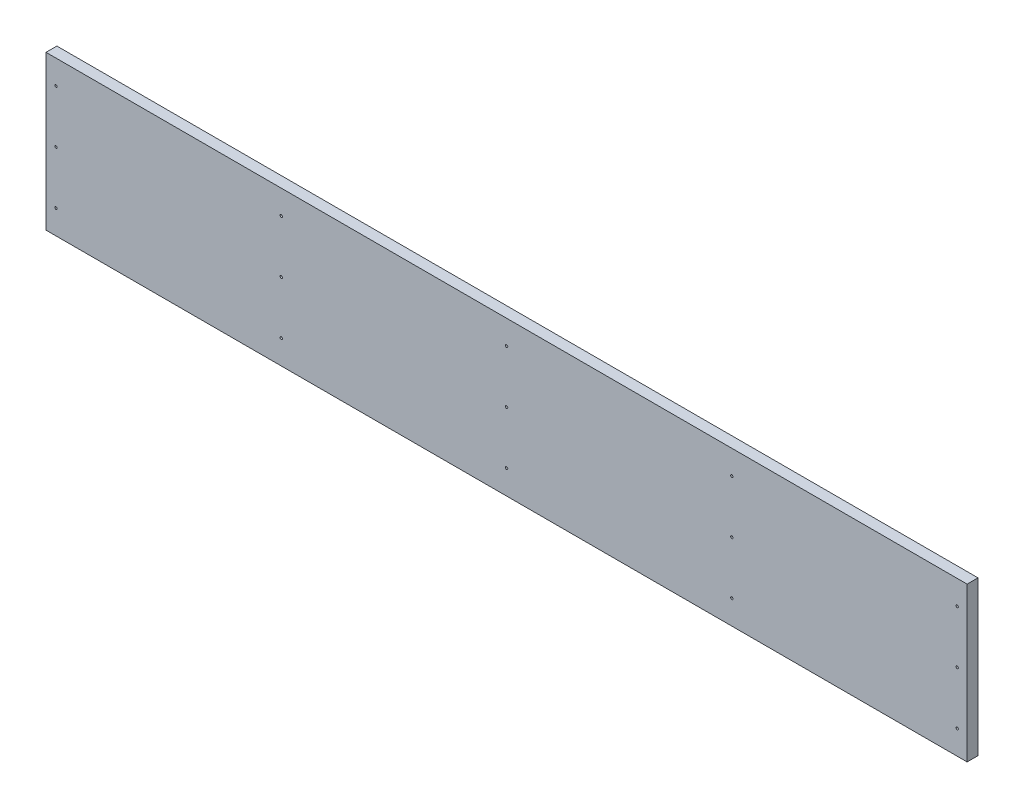
ISO-10303-21;
HEADER;
FILE_DESCRIPTION(('STEP AP214'),'2;1');
FILE_NAME('part.step','',(''),(''),'','','');
FILE_SCHEMA(('AUTOMOTIVE_DESIGN { 1 0 10303 214 1 1 1 1 }'));
ENDSEC;
DATA;
#1=APPLICATION_CONTEXT('core data for automotive mechanical design processes');
#2=APPLICATION_PROTOCOL_DEFINITION('international standard','automotive_design',2000,#1);
#3=PRODUCT_CONTEXT('',#1,'mechanical');
#4=PRODUCT('Part','Part','',(#3));
#5=PRODUCT_RELATED_PRODUCT_CATEGORY('part','',(#4));
#6=PRODUCT_DEFINITION_FORMATION('','',#4);
#7=PRODUCT_DEFINITION_CONTEXT('part definition',#1,'design');
#8=PRODUCT_DEFINITION('design','',#6,#7);
#9=PRODUCT_DEFINITION_SHAPE('','',#8);
#10=(LENGTH_UNIT() NAMED_UNIT(*) SI_UNIT(.MILLI.,.METRE.));
#11=(NAMED_UNIT(*) PLANE_ANGLE_UNIT() SI_UNIT($,.RADIAN.));
#12=(NAMED_UNIT(*) SI_UNIT($,.STERADIAN.) SOLID_ANGLE_UNIT());
#13=UNCERTAINTY_MEASURE_WITH_UNIT(LENGTH_MEASURE(1.E-05),#10,'distance_accuracy_value','');
#14=(GEOMETRIC_REPRESENTATION_CONTEXT(3) GLOBAL_UNCERTAINTY_ASSIGNED_CONTEXT((#13)) GLOBAL_UNIT_ASSIGNED_CONTEXT((#10,
#11,#12)) REPRESENTATION_CONTEXT('',''));
#15=CARTESIAN_POINT('',(0.,0.,0.));
#16=DIRECTION('',(0.,0.,1.));
#17=DIRECTION('',(1.,0.,0.));
#18=AXIS2_PLACEMENT_3D('',#15,#16,#17);
#19=CARTESIAN_POINT('',(762.499999999999,127.5,18.));
#20=DIRECTION('',(-1.,0.,0.));
#21=DIRECTION('',(0.,-1.,0.));
#22=AXIS2_PLACEMENT_3D('',#19,#20,#21);
#23=PLANE('',#22);
#24=DIRECTION('',(0.,1.,0.));
#25=VECTOR('',#24,1.);
#26=CARTESIAN_POINT('',(762.499999999999,127.5,0.));
#27=LINE('',#26,#25);
#28=CARTESIAN_POINT('',(762.499999999999,-127.5,0.));
#29=VERTEX_POINT('',#28);
#30=CARTESIAN_POINT('',(762.499999999999,127.5,0.));
#31=VERTEX_POINT('',#30);
#32=EDGE_CURVE('E107',#29,#31,#27,.T.);
#33=ORIENTED_EDGE('',*,*,#32,.T.);
#34=DIRECTION('',(0.,0.,-1.));
#35=VECTOR('',#34,1.);
#36=CARTESIAN_POINT('',(762.499999999999,127.5,18.));
#37=LINE('',#36,#35);
#38=CARTESIAN_POINT('',(762.499999999999,127.5,18.));
#39=VERTEX_POINT('',#38);
#40=EDGE_CURVE('E13',#39,#31,#37,.T.);
#41=ORIENTED_EDGE('',*,*,#40,.F.);
#42=DIRECTION('',(0.,1.,0.));
#43=VECTOR('',#42,1.);
#44=CARTESIAN_POINT('',(762.499999999999,127.5,18.));
#45=LINE('',#44,#43);
#46=CARTESIAN_POINT('',(762.499999999999,-127.5,18.));
#47=VERTEX_POINT('',#46);
#48=EDGE_CURVE('E95',#47,#39,#45,.T.);
#49=ORIENTED_EDGE('',*,*,#48,.F.);
#50=DIRECTION('',(0.,0.,-1.));
#51=VECTOR('',#50,1.);
#52=CARTESIAN_POINT('',(762.499999999999,-127.5,18.));
#53=LINE('',#52,#51);
#54=EDGE_CURVE('E103',#47,#29,#53,.T.);
#55=ORIENTED_EDGE('',*,*,#54,.T.);
#56=EDGE_LOOP('',(#33,#41,#49,#55));
#57=FACE_BOUND('',#56,.T.);
#58=ADVANCED_FACE('F44',(#57),#23,.F.);
#59=CARTESIAN_POINT('',(-762.500000000001,127.5,18.));
#60=DIRECTION('',(0.,-1.,0.));
#61=DIRECTION('',(0.,0.,-1.));
#62=AXIS2_PLACEMENT_3D('',#59,#60,#61);
#63=PLANE('',#62);
#64=DIRECTION('',(-1.,0.,0.));
#65=VECTOR('',#64,1.);
#66=CARTESIAN_POINT('',(-762.500000000001,127.5,0.));
#67=LINE('',#66,#65);
#68=CARTESIAN_POINT('',(-762.500000000001,127.5,0.));
#69=VERTEX_POINT('',#68);
#70=EDGE_CURVE('E99',#31,#69,#67,.T.);
#71=ORIENTED_EDGE('',*,*,#70,.T.);
#72=DIRECTION('',(0.,0.,-1.));
#73=VECTOR('',#72,1.);
#74=CARTESIAN_POINT('',(-762.500000000001,127.5,18.));
#75=LINE('',#74,#73);
#76=CARTESIAN_POINT('',(-762.500000000001,127.5,18.));
#77=VERTEX_POINT('',#76);
#78=EDGE_CURVE('E52',#77,#69,#75,.T.);
#79=ORIENTED_EDGE('',*,*,#78,.F.);
#80=DIRECTION('',(-1.,0.,0.));
#81=VECTOR('',#80,1.);
#82=CARTESIAN_POINT('',(-762.500000000001,127.5,18.));
#83=LINE('',#82,#81);
#84=EDGE_CURVE('E90',#39,#77,#83,.T.);
#85=ORIENTED_EDGE('',*,*,#84,.F.);
#86=ORIENTED_EDGE('',*,*,#40,.T.);
#87=EDGE_LOOP('',(#71,#79,#85,#86));
#88=FACE_BOUND('',#87,.T.);
#89=ADVANCED_FACE('F98',(#88),#63,.F.);
#90=CARTESIAN_POINT('',(-762.500000000001,127.5,18.));
#91=DIRECTION('',(1.,0.,0.));
#92=DIRECTION('',(0.,0.,-1.));
#93=AXIS2_PLACEMENT_3D('',#90,#91,#92);
#94=PLANE('',#93);
#95=DIRECTION('',(0.,-1.,0.));
#96=VECTOR('',#95,1.);
#97=CARTESIAN_POINT('',(-762.500000000001,127.5,0.));
#98=LINE('',#97,#96);
#99=CARTESIAN_POINT('',(-762.500000000001,-127.5,0.));
#100=VERTEX_POINT('',#99);
#101=EDGE_CURVE('E77',#69,#100,#98,.T.);
#102=ORIENTED_EDGE('',*,*,#101,.T.);
#103=DIRECTION('',(0.,0.,-1.));
#104=VECTOR('',#103,1.);
#105=CARTESIAN_POINT('',(-762.500000000001,-127.5,18.));
#106=LINE('',#105,#104);
#107=CARTESIAN_POINT('',(-762.500000000001,-127.5,18.));
#108=VERTEX_POINT('',#107);
#109=EDGE_CURVE('E100',#108,#100,#106,.T.);
#110=ORIENTED_EDGE('',*,*,#109,.F.);
#111=DIRECTION('',(0.,-1.,0.));
#112=VECTOR('',#111,1.);
#113=CARTESIAN_POINT('',(-762.500000000001,127.5,18.));
#114=LINE('',#113,#112);
#115=EDGE_CURVE('E93',#77,#108,#114,.T.);
#116=ORIENTED_EDGE('',*,*,#115,.F.);
#117=ORIENTED_EDGE('',*,*,#78,.T.);
#118=EDGE_LOOP('',(#102,#110,#116,#117));
#119=FACE_BOUND('',#118,.T.);
#120=ADVANCED_FACE('F101',(#119),#94,.F.);
#121=CARTESIAN_POINT('',(-762.500000000001,-127.5,18.));
#122=DIRECTION('',(0.,1.,0.));
#123=DIRECTION('',(0.,0.,1.));
#124=AXIS2_PLACEMENT_3D('',#121,#122,#123);
#125=PLANE('',#124);
#126=DIRECTION('',(1.,0.,0.));
#127=VECTOR('',#126,1.);
#128=CARTESIAN_POINT('',(-762.500000000001,-127.5,0.));
#129=LINE('',#128,#127);
#130=EDGE_CURVE('E83',#100,#29,#129,.T.);
#131=ORIENTED_EDGE('',*,*,#130,.T.);
#132=ORIENTED_EDGE('',*,*,#54,.F.);
#133=DIRECTION('',(1.,0.,0.));
#134=VECTOR('',#133,1.);
#135=CARTESIAN_POINT('',(-762.500000000001,-127.5,18.));
#136=LINE('',#135,#134);
#137=EDGE_CURVE('E60',#108,#47,#136,.T.);
#138=ORIENTED_EDGE('',*,*,#137,.F.);
#139=ORIENTED_EDGE('',*,*,#109,.T.);
#140=EDGE_LOOP('',(#131,#132,#138,#139));
#141=FACE_BOUND('',#140,.T.);
#142=ADVANCED_FACE('F115',(#141),#125,.F.);
#143=CARTESIAN_POINT('',(0.,0.,18.));
#144=DIRECTION('',(0.,0.,1.));
#145=DIRECTION('',(1.,0.,0.));
#146=AXIS2_PLACEMENT_3D('',#143,#144,#145);
#147=PLANE('',#146);
#148=CARTESIAN_POINT('',(-6.66133814775094E-13,-87.5,18.));
#149=DIRECTION('',(0.,0.,1.));
#150=DIRECTION('',(1.,0.,0.));
#151=AXIS2_PLACEMENT_3D('',#148,#149,#150);
#152=CIRCLE('',#151,2.);
#153=CARTESIAN_POINT('',(1.99999999999933,-87.5,18.));
#154=VERTEX_POINT('',#153);
#155=EDGE_CURVE('E180',#154,#154,#152,.T.);
#156=ORIENTED_EDGE('',*,*,#155,.F.);
#157=EDGE_LOOP('',(#156));
#158=FACE_BOUND('',#157,.T.);
#159=CARTESIAN_POINT('',(372.999999999999,87.4999999999999,18.));
#160=DIRECTION('',(0.,0.,1.));
#161=DIRECTION('',(1.,0.,0.));
#162=AXIS2_PLACEMENT_3D('',#159,#160,#161);
#163=CIRCLE('',#162,2.);
#164=CARTESIAN_POINT('',(374.999999999999,87.4999999999999,18.));
#165=VERTEX_POINT('',#164);
#166=EDGE_CURVE('E172',#165,#165,#163,.T.);
#167=ORIENTED_EDGE('',*,*,#166,.F.);
#168=EDGE_LOOP('',(#167));
#169=FACE_BOUND('',#168,.T.);
#170=CARTESIAN_POINT('',(372.999999999999,0.,18.));
#171=DIRECTION('',(0.,0.,1.));
#172=DIRECTION('',(1.,0.,0.));
#173=AXIS2_PLACEMENT_3D('',#170,#171,#172);
#174=CIRCLE('',#173,2.);
#175=CARTESIAN_POINT('',(374.999999999999,0.,18.));
#176=VERTEX_POINT('',#175);
#177=EDGE_CURVE('E173',#176,#176,#174,.T.);
#178=ORIENTED_EDGE('',*,*,#177,.F.);
#179=EDGE_LOOP('',(#178));
#180=FACE_BOUND('',#179,.T.);
#181=CARTESIAN_POINT('',(745.999999999999,-87.5,18.));
#182=DIRECTION('',(0.,0.,1.));
#183=DIRECTION('',(1.,0.,0.));
#184=AXIS2_PLACEMENT_3D('',#181,#182,#183);
#185=CIRCLE('',#184,2.);
#186=CARTESIAN_POINT('',(747.999999999999,-87.5,18.));
#187=VERTEX_POINT('',#186);
#188=EDGE_CURVE('E203',#187,#187,#185,.T.);
#189=ORIENTED_EDGE('',*,*,#188,.F.);
#190=EDGE_LOOP('',(#189));
#191=FACE_BOUND('',#190,.T.);
#192=CARTESIAN_POINT('',(745.999999999999,0.,18.));
#193=DIRECTION('',(0.,0.,1.));
#194=DIRECTION('',(1.,0.,0.));
#195=AXIS2_PLACEMENT_3D('',#192,#193,#194);
#196=CIRCLE('',#195,2.);
#197=CARTESIAN_POINT('',(747.999999999999,0.,18.));
#198=VERTEX_POINT('',#197);
#199=EDGE_CURVE('E202',#198,#198,#196,.T.);
#200=ORIENTED_EDGE('',*,*,#199,.F.);
#201=EDGE_LOOP('',(#200));
#202=FACE_BOUND('',#201,.T.);
#203=CARTESIAN_POINT('',(745.999999999999,87.4999999999999,18.));
#204=DIRECTION('',(0.,0.,1.));
#205=DIRECTION('',(1.,0.,0.));
#206=AXIS2_PLACEMENT_3D('',#203,#204,#205);
#207=CIRCLE('',#206,2.);
#208=CARTESIAN_POINT('',(747.999999999999,87.4999999999999,18.));
#209=VERTEX_POINT('',#208);
#210=EDGE_CURVE('E191',#209,#209,#207,.T.);
#211=ORIENTED_EDGE('',*,*,#210,.F.);
#212=EDGE_LOOP('',(#211));
#213=FACE_BOUND('',#212,.T.);
#214=CARTESIAN_POINT('',(372.999999999999,-87.5,18.));
#215=DIRECTION('',(0.,0.,1.));
#216=DIRECTION('',(1.,0.,0.));
#217=AXIS2_PLACEMENT_3D('',#214,#215,#216);
#218=CIRCLE('',#217,2.);
#219=CARTESIAN_POINT('',(374.999999999999,-87.5,18.));
#220=VERTEX_POINT('',#219);
#221=EDGE_CURVE('E190',#220,#220,#218,.T.);
#222=ORIENTED_EDGE('',*,*,#221,.F.);
#223=EDGE_LOOP('',(#222));
#224=FACE_BOUND('',#223,.T.);
#225=CARTESIAN_POINT('',(-373.000000000001,87.4999999999999,18.));
#226=DIRECTION('',(0.,0.,1.));
#227=DIRECTION('',(1.,0.,0.));
#228=AXIS2_PLACEMENT_3D('',#225,#226,#227);
#229=CIRCLE('',#228,2.);
#230=CARTESIAN_POINT('',(-371.000000000001,87.4999999999999,18.));
#231=VERTEX_POINT('',#230);
#232=EDGE_CURVE('E137',#231,#231,#229,.T.);
#233=ORIENTED_EDGE('',*,*,#232,.F.);
#234=EDGE_LOOP('',(#233));
#235=FACE_BOUND('',#234,.T.);
#236=CARTESIAN_POINT('',(-746.000000000001,-87.5,18.));
#237=DIRECTION('',(0.,0.,1.));
#238=DIRECTION('',(1.,0.,0.));
#239=AXIS2_PLACEMENT_3D('',#236,#237,#238);
#240=CIRCLE('',#239,2.);
#241=CARTESIAN_POINT('',(-744.000000000001,-87.5,18.));
#242=VERTEX_POINT('',#241);
#243=EDGE_CURVE('E136',#242,#242,#240,.T.);
#244=ORIENTED_EDGE('',*,*,#243,.F.);
#245=EDGE_LOOP('',(#244));
#246=FACE_BOUND('',#245,.T.);
#247=CARTESIAN_POINT('',(-746.000000000001,0.,18.));
#248=DIRECTION('',(0.,0.,1.));
#249=DIRECTION('',(1.,0.,0.));
#250=AXIS2_PLACEMENT_3D('',#247,#248,#249);
#251=CIRCLE('',#250,2.);
#252=CARTESIAN_POINT('',(-744.000000000001,0.,18.));
#253=VERTEX_POINT('',#252);
#254=EDGE_CURVE('E129',#253,#253,#251,.T.);
#255=ORIENTED_EDGE('',*,*,#254,.F.);
#256=EDGE_LOOP('',(#255));
#257=FACE_BOUND('',#256,.T.);
#258=CARTESIAN_POINT('',(-373.000000000001,0.,18.));
#259=DIRECTION('',(0.,0.,1.));
#260=DIRECTION('',(1.,0.,0.));
#261=AXIS2_PLACEMENT_3D('',#258,#259,#260);
#262=CIRCLE('',#261,2.);
#263=CARTESIAN_POINT('',(-371.000000000001,0.,18.));
#264=VERTEX_POINT('',#263);
#265=EDGE_CURVE('E162',#264,#264,#262,.T.);
#266=ORIENTED_EDGE('',*,*,#265,.F.);
#267=EDGE_LOOP('',(#266));
#268=FACE_BOUND('',#267,.T.);
#269=CARTESIAN_POINT('',(-373.000000000001,-87.5,18.));
#270=DIRECTION('',(0.,0.,1.));
#271=DIRECTION('',(1.,0.,0.));
#272=AXIS2_PLACEMENT_3D('',#269,#270,#271);
#273=CIRCLE('',#272,2.);
#274=CARTESIAN_POINT('',(-371.000000000001,-87.5,18.));
#275=VERTEX_POINT('',#274);
#276=EDGE_CURVE('E156',#275,#275,#273,.T.);
#277=ORIENTED_EDGE('',*,*,#276,.F.);
#278=EDGE_LOOP('',(#277));
#279=FACE_BOUND('',#278,.T.);
#280=CARTESIAN_POINT('',(-6.66133814775094E-13,87.4999999999999,18.));
#281=DIRECTION('',(0.,0.,1.));
#282=DIRECTION('',(1.,0.,0.));
#283=AXIS2_PLACEMENT_3D('',#280,#281,#282);
#284=CIRCLE('',#283,2.);
#285=CARTESIAN_POINT('',(1.99999999999933,87.4999999999999,18.));
#286=VERTEX_POINT('',#285);
#287=EDGE_CURVE('E148',#286,#286,#284,.T.);
#288=ORIENTED_EDGE('',*,*,#287,.F.);
#289=EDGE_LOOP('',(#288));
#290=FACE_BOUND('',#289,.T.);
#291=CARTESIAN_POINT('',(-6.66133814775094E-13,0.,18.));
#292=DIRECTION('',(0.,0.,1.));
#293=DIRECTION('',(1.,0.,0.));
#294=AXIS2_PLACEMENT_3D('',#291,#292,#293);
#295=CIRCLE('',#294,2.);
#296=CARTESIAN_POINT('',(1.99999999999933,0.,18.));
#297=VERTEX_POINT('',#296);
#298=EDGE_CURVE('E149',#297,#297,#295,.T.);
#299=ORIENTED_EDGE('',*,*,#298,.F.);
#300=EDGE_LOOP('',(#299));
#301=FACE_BOUND('',#300,.T.);
#302=CARTESIAN_POINT('',(-746.000000000001,87.4999999999999,18.));
#303=DIRECTION('',(0.,0.,1.));
#304=DIRECTION('',(1.,0.,0.));
#305=AXIS2_PLACEMENT_3D('',#302,#303,#304);
#306=CIRCLE('',#305,2.);
#307=CARTESIAN_POINT('',(-744.000000000001,87.4999999999999,18.));
#308=VERTEX_POINT('',#307);
#309=EDGE_CURVE('E123',#308,#308,#306,.T.);
#310=ORIENTED_EDGE('',*,*,#309,.F.);
#311=EDGE_LOOP('',(#310));
#312=FACE_BOUND('',#311,.T.);
#313=ORIENTED_EDGE('',*,*,#48,.T.);
#314=ORIENTED_EDGE('',*,*,#84,.T.);
#315=ORIENTED_EDGE('',*,*,#115,.T.);
#316=ORIENTED_EDGE('',*,*,#137,.T.);
#317=EDGE_LOOP('',(#313,#314,#315,#316));
#318=FACE_BOUND('',#317,.T.);
#319=ADVANCED_FACE('F91',(#158,#169,#180,#191,#202,#213,#224,#235,#246,#257,#268,#279,#290,#301,
#312,#318),#147,.T.);
#320=CARTESIAN_POINT('',(0.,0.,0.));
#321=DIRECTION('',(0.,0.,1.));
#322=DIRECTION('',(1.,0.,0.));
#323=AXIS2_PLACEMENT_3D('',#320,#321,#322);
#324=PLANE('',#323);
#325=CARTESIAN_POINT('',(-6.66133814775094E-13,-87.5,0.));
#326=DIRECTION('',(0.,0.,1.));
#327=DIRECTION('',(1.,0.,0.));
#328=AXIS2_PLACEMENT_3D('',#325,#326,#327);
#329=CIRCLE('',#328,2.);
#330=CARTESIAN_POINT('',(1.99999999999933,-87.5,0.));
#331=VERTEX_POINT('',#330);
#332=EDGE_CURVE('E152',#331,#331,#329,.F.);
#333=ORIENTED_EDGE('',*,*,#332,.F.);
#334=EDGE_LOOP('',(#333));
#335=FACE_BOUND('',#334,.T.);
#336=CARTESIAN_POINT('',(372.999999999999,87.4999999999999,0.));
#337=DIRECTION('',(0.,0.,1.));
#338=DIRECTION('',(1.,0.,0.));
#339=AXIS2_PLACEMENT_3D('',#336,#337,#338);
#340=CIRCLE('',#339,2.);
#341=CARTESIAN_POINT('',(374.999999999999,87.4999999999999,0.));
#342=VERTEX_POINT('',#341);
#343=EDGE_CURVE('E177',#342,#342,#340,.F.);
#344=ORIENTED_EDGE('',*,*,#343,.F.);
#345=EDGE_LOOP('',(#344));
#346=FACE_BOUND('',#345,.T.);
#347=CARTESIAN_POINT('',(372.999999999999,0.,0.));
#348=DIRECTION('',(0.,0.,1.));
#349=DIRECTION('',(1.,0.,0.));
#350=AXIS2_PLACEMENT_3D('',#347,#348,#349);
#351=CIRCLE('',#350,2.);
#352=CARTESIAN_POINT('',(374.999999999999,0.,0.));
#353=VERTEX_POINT('',#352);
#354=EDGE_CURVE('E169',#353,#353,#351,.F.);
#355=ORIENTED_EDGE('',*,*,#354,.F.);
#356=EDGE_LOOP('',(#355));
#357=FACE_BOUND('',#356,.T.);
#358=CARTESIAN_POINT('',(745.999999999999,-87.5,0.));
#359=DIRECTION('',(0.,0.,1.));
#360=DIRECTION('',(1.,0.,0.));
#361=AXIS2_PLACEMENT_3D('',#358,#359,#360);
#362=CIRCLE('',#361,2.);
#363=CARTESIAN_POINT('',(747.999999999999,-87.5,0.));
#364=VERTEX_POINT('',#363);
#365=EDGE_CURVE('E199',#364,#364,#362,.F.);
#366=ORIENTED_EDGE('',*,*,#365,.F.);
#367=EDGE_LOOP('',(#366));
#368=FACE_BOUND('',#367,.T.);
#369=CARTESIAN_POINT('',(745.999999999999,0.,0.));
#370=DIRECTION('',(0.,0.,1.));
#371=DIRECTION('',(1.,0.,0.));
#372=AXIS2_PLACEMENT_3D('',#369,#370,#371);
#373=CIRCLE('',#372,2.);
#374=CARTESIAN_POINT('',(747.999999999999,0.,0.));
#375=VERTEX_POINT('',#374);
#376=EDGE_CURVE('E194',#375,#375,#373,.F.);
#377=ORIENTED_EDGE('',*,*,#376,.F.);
#378=EDGE_LOOP('',(#377));
#379=FACE_BOUND('',#378,.T.);
#380=CARTESIAN_POINT('',(745.999999999999,87.4999999999999,0.));
#381=DIRECTION('',(0.,0.,1.));
#382=DIRECTION('',(1.,0.,0.));
#383=AXIS2_PLACEMENT_3D('',#380,#381,#382);
#384=CIRCLE('',#383,2.);
#385=CARTESIAN_POINT('',(747.999999999999,87.4999999999999,0.));
#386=VERTEX_POINT('',#385);
#387=EDGE_CURVE('E187',#386,#386,#384,.F.);
#388=ORIENTED_EDGE('',*,*,#387,.F.);
#389=EDGE_LOOP('',(#388));
#390=FACE_BOUND('',#389,.T.);
#391=CARTESIAN_POINT('',(372.999999999999,-87.5,0.));
#392=DIRECTION('',(0.,0.,1.));
#393=DIRECTION('',(1.,0.,0.));
#394=AXIS2_PLACEMENT_3D('',#391,#392,#393);
#395=CIRCLE('',#394,2.);
#396=CARTESIAN_POINT('',(374.999999999999,-87.5,0.));
#397=VERTEX_POINT('',#396);
#398=EDGE_CURVE('E176',#397,#397,#395,.F.);
#399=ORIENTED_EDGE('',*,*,#398,.F.);
#400=EDGE_LOOP('',(#399));
#401=FACE_BOUND('',#400,.T.);
#402=CARTESIAN_POINT('',(-373.000000000001,87.4999999999999,0.));
#403=DIRECTION('',(0.,0.,1.));
#404=DIRECTION('',(1.,0.,0.));
#405=AXIS2_PLACEMENT_3D('',#402,#403,#404);
#406=CIRCLE('',#405,2.);
#407=CARTESIAN_POINT('',(-371.000000000001,87.4999999999999,0.));
#408=VERTEX_POINT('',#407);
#409=EDGE_CURVE('E133',#408,#408,#406,.F.);
#410=ORIENTED_EDGE('',*,*,#409,.F.);
#411=EDGE_LOOP('',(#410));
#412=FACE_BOUND('',#411,.T.);
#413=CARTESIAN_POINT('',(-746.000000000001,-87.5,0.));
#414=DIRECTION('',(0.,0.,1.));
#415=DIRECTION('',(1.,0.,0.));
#416=AXIS2_PLACEMENT_3D('',#413,#414,#415);
#417=CIRCLE('',#416,2.);
#418=CARTESIAN_POINT('',(-744.000000000001,-87.5,0.));
#419=VERTEX_POINT('',#418);
#420=EDGE_CURVE('E132',#419,#419,#417,.F.);
#421=ORIENTED_EDGE('',*,*,#420,.F.);
#422=EDGE_LOOP('',(#421));
#423=FACE_BOUND('',#422,.T.);
#424=CARTESIAN_POINT('',(-746.000000000001,0.,0.));
#425=DIRECTION('',(0.,0.,1.));
#426=DIRECTION('',(1.,0.,0.));
#427=AXIS2_PLACEMENT_3D('',#424,#425,#426);
#428=CIRCLE('',#427,2.);
#429=CARTESIAN_POINT('',(-744.000000000001,0.,0.));
#430=VERTEX_POINT('',#429);
#431=EDGE_CURVE('E126',#430,#430,#428,.F.);
#432=ORIENTED_EDGE('',*,*,#431,.F.);
#433=EDGE_LOOP('',(#432));
#434=FACE_BOUND('',#433,.T.);
#435=CARTESIAN_POINT('',(-373.000000000001,0.,0.));
#436=DIRECTION('',(0.,0.,1.));
#437=DIRECTION('',(1.,0.,0.));
#438=AXIS2_PLACEMENT_3D('',#435,#436,#437);
#439=CIRCLE('',#438,2.);
#440=CARTESIAN_POINT('',(-371.000000000001,0.,0.));
#441=VERTEX_POINT('',#440);
#442=EDGE_CURVE('E140',#441,#441,#439,.F.);
#443=ORIENTED_EDGE('',*,*,#442,.F.);
#444=EDGE_LOOP('',(#443));
#445=FACE_BOUND('',#444,.T.);
#446=CARTESIAN_POINT('',(-373.000000000001,-87.5,0.));
#447=DIRECTION('',(0.,0.,1.));
#448=DIRECTION('',(1.,0.,0.));
#449=AXIS2_PLACEMENT_3D('',#446,#447,#448);
#450=CIRCLE('',#449,2.);
#451=CARTESIAN_POINT('',(-371.000000000001,-87.5,0.));
#452=VERTEX_POINT('',#451);
#453=EDGE_CURVE('E159',#452,#452,#450,.F.);
#454=ORIENTED_EDGE('',*,*,#453,.F.);
#455=EDGE_LOOP('',(#454));
#456=FACE_BOUND('',#455,.T.);
#457=CARTESIAN_POINT('',(-6.66133814775094E-13,87.4999999999999,0.));
#458=DIRECTION('',(0.,0.,1.));
#459=DIRECTION('',(1.,0.,0.));
#460=AXIS2_PLACEMENT_3D('',#457,#458,#459);
#461=CIRCLE('',#460,2.);
#462=CARTESIAN_POINT('',(1.99999999999933,87.4999999999999,0.));
#463=VERTEX_POINT('',#462);
#464=EDGE_CURVE('E153',#463,#463,#461,.F.);
#465=ORIENTED_EDGE('',*,*,#464,.F.);
#466=EDGE_LOOP('',(#465));
#467=FACE_BOUND('',#466,.T.);
#468=CARTESIAN_POINT('',(-6.66133814775094E-13,0.,0.));
#469=DIRECTION('',(0.,0.,1.));
#470=DIRECTION('',(1.,0.,0.));
#471=AXIS2_PLACEMENT_3D('',#468,#469,#470);
#472=CIRCLE('',#471,2.);
#473=CARTESIAN_POINT('',(1.99999999999933,0.,0.));
#474=VERTEX_POINT('',#473);
#475=EDGE_CURVE('E145',#474,#474,#472,.F.);
#476=ORIENTED_EDGE('',*,*,#475,.F.);
#477=EDGE_LOOP('',(#476));
#478=FACE_BOUND('',#477,.T.);
#479=CARTESIAN_POINT('',(-746.000000000001,87.4999999999999,0.));
#480=DIRECTION('',(0.,0.,1.));
#481=DIRECTION('',(1.,0.,0.));
#482=AXIS2_PLACEMENT_3D('',#479,#480,#481);
#483=CIRCLE('',#482,2.);
#484=CARTESIAN_POINT('',(-744.000000000001,87.4999999999999,0.));
#485=VERTEX_POINT('',#484);
#486=EDGE_CURVE('E110',#485,#485,#483,.F.);
#487=ORIENTED_EDGE('',*,*,#486,.F.);
#488=EDGE_LOOP('',(#487));
#489=FACE_BOUND('',#488,.T.);
#490=ORIENTED_EDGE('',*,*,#32,.F.);
#491=ORIENTED_EDGE('',*,*,#130,.F.);
#492=ORIENTED_EDGE('',*,*,#101,.F.);
#493=ORIENTED_EDGE('',*,*,#70,.F.);
#494=EDGE_LOOP('',(#490,#491,#492,#493));
#495=FACE_BOUND('',#494,.T.);
#496=ADVANCED_FACE('F118',(#335,#346,#357,#368,#379,#390,#401,#412,#423,#434,#445,#456,#467,
#478,#489,#495),#324,.F.);
#497=CARTESIAN_POINT('',(-746.000000000001,87.4999999999999,-0.001000000000001));
#498=DIRECTION('',(0.,0.,1.));
#499=DIRECTION('',(1.,0.,0.));
#500=AXIS2_PLACEMENT_3D('',#497,#498,#499);
#501=CYLINDRICAL_SURFACE('',#500,2.);
#502=ORIENTED_EDGE('',*,*,#309,.T.);
#503=EDGE_LOOP('',(#502));
#504=FACE_BOUND('',#503,.T.);
#505=ORIENTED_EDGE('',*,*,#486,.T.);
#506=EDGE_LOOP('',(#505));
#507=FACE_BOUND('',#506,.T.);
#508=ADVANCED_FACE('F238',(#504,#507),#501,.F.);
#509=CARTESIAN_POINT('',(-6.66133814775094E-13,0.,-0.001000000000001));
#510=DIRECTION('',(0.,0.,1.));
#511=DIRECTION('',(1.,0.,0.));
#512=AXIS2_PLACEMENT_3D('',#509,#510,#511);
#513=CYLINDRICAL_SURFACE('',#512,2.);
#514=ORIENTED_EDGE('',*,*,#298,.T.);
#515=EDGE_LOOP('',(#514));
#516=FACE_BOUND('',#515,.T.);
#517=ORIENTED_EDGE('',*,*,#475,.T.);
#518=EDGE_LOOP('',(#517));
#519=FACE_BOUND('',#518,.T.);
#520=ADVANCED_FACE('F241',(#516,#519),#513,.F.);
#521=CARTESIAN_POINT('',(-6.66133814775094E-13,87.4999999999999,-0.001000000000001));
#522=DIRECTION('',(0.,0.,1.));
#523=DIRECTION('',(1.,0.,0.));
#524=AXIS2_PLACEMENT_3D('',#521,#522,#523);
#525=CYLINDRICAL_SURFACE('',#524,2.);
#526=ORIENTED_EDGE('',*,*,#287,.T.);
#527=EDGE_LOOP('',(#526));
#528=FACE_BOUND('',#527,.T.);
#529=ORIENTED_EDGE('',*,*,#464,.T.);
#530=EDGE_LOOP('',(#529));
#531=FACE_BOUND('',#530,.T.);
#532=ADVANCED_FACE('F283',(#528,#531),#525,.F.);
#533=CARTESIAN_POINT('',(-373.000000000001,-87.5,-0.001000000000001));
#534=DIRECTION('',(0.,0.,1.));
#535=DIRECTION('',(1.,0.,0.));
#536=AXIS2_PLACEMENT_3D('',#533,#534,#535);
#537=CYLINDRICAL_SURFACE('',#536,2.);
#538=ORIENTED_EDGE('',*,*,#276,.T.);
#539=EDGE_LOOP('',(#538));
#540=FACE_BOUND('',#539,.T.);
#541=ORIENTED_EDGE('',*,*,#453,.T.);
#542=EDGE_LOOP('',(#541));
#543=FACE_BOUND('',#542,.T.);
#544=ADVANCED_FACE('F291',(#540,#543),#537,.F.);
#545=CARTESIAN_POINT('',(-373.000000000001,0.,-0.001000000000001));
#546=DIRECTION('',(0.,0.,1.));
#547=DIRECTION('',(1.,0.,0.));
#548=AXIS2_PLACEMENT_3D('',#545,#546,#547);
#549=CYLINDRICAL_SURFACE('',#548,2.);
#550=ORIENTED_EDGE('',*,*,#265,.T.);
#551=EDGE_LOOP('',(#550));
#552=FACE_BOUND('',#551,.T.);
#553=ORIENTED_EDGE('',*,*,#442,.T.);
#554=EDGE_LOOP('',(#553));
#555=FACE_BOUND('',#554,.T.);
#556=ADVANCED_FACE('F299',(#552,#555),#549,.F.);
#557=CARTESIAN_POINT('',(-746.000000000001,0.,-0.001000000000001));
#558=DIRECTION('',(0.,0.,1.));
#559=DIRECTION('',(1.,0.,0.));
#560=AXIS2_PLACEMENT_3D('',#557,#558,#559);
#561=CYLINDRICAL_SURFACE('',#560,2.);
#562=ORIENTED_EDGE('',*,*,#254,.T.);
#563=EDGE_LOOP('',(#562));
#564=FACE_BOUND('',#563,.T.);
#565=ORIENTED_EDGE('',*,*,#431,.T.);
#566=EDGE_LOOP('',(#565));
#567=FACE_BOUND('',#566,.T.);
#568=ADVANCED_FACE('F307',(#564,#567),#561,.F.);
#569=CARTESIAN_POINT('',(-746.000000000001,-87.5,-0.001000000000001));
#570=DIRECTION('',(0.,0.,1.));
#571=DIRECTION('',(1.,0.,0.));
#572=AXIS2_PLACEMENT_3D('',#569,#570,#571);
#573=CYLINDRICAL_SURFACE('',#572,2.);
#574=ORIENTED_EDGE('',*,*,#243,.T.);
#575=EDGE_LOOP('',(#574));
#576=FACE_BOUND('',#575,.T.);
#577=ORIENTED_EDGE('',*,*,#420,.T.);
#578=EDGE_LOOP('',(#577));
#579=FACE_BOUND('',#578,.T.);
#580=ADVANCED_FACE('F315',(#576,#579),#573,.F.);
#581=CARTESIAN_POINT('',(-373.000000000001,87.4999999999999,-0.001000000000001));
#582=DIRECTION('',(0.,0.,1.));
#583=DIRECTION('',(1.,0.,0.));
#584=AXIS2_PLACEMENT_3D('',#581,#582,#583);
#585=CYLINDRICAL_SURFACE('',#584,2.);
#586=ORIENTED_EDGE('',*,*,#232,.T.);
#587=EDGE_LOOP('',(#586));
#588=FACE_BOUND('',#587,.T.);
#589=ORIENTED_EDGE('',*,*,#409,.T.);
#590=EDGE_LOOP('',(#589));
#591=FACE_BOUND('',#590,.T.);
#592=ADVANCED_FACE('F323',(#588,#591),#585,.F.);
#593=CARTESIAN_POINT('',(372.999999999999,-87.5,-0.001000000000001));
#594=DIRECTION('',(0.,0.,1.));
#595=DIRECTION('',(1.,0.,0.));
#596=AXIS2_PLACEMENT_3D('',#593,#594,#595);
#597=CYLINDRICAL_SURFACE('',#596,2.);
#598=ORIENTED_EDGE('',*,*,#221,.T.);
#599=EDGE_LOOP('',(#598));
#600=FACE_BOUND('',#599,.T.);
#601=ORIENTED_EDGE('',*,*,#398,.T.);
#602=EDGE_LOOP('',(#601));
#603=FACE_BOUND('',#602,.T.);
#604=ADVANCED_FACE('F331',(#600,#603),#597,.F.);
#605=CARTESIAN_POINT('',(745.999999999999,87.4999999999999,-0.001000000000001));
#606=DIRECTION('',(0.,0.,1.));
#607=DIRECTION('',(1.,0.,0.));
#608=AXIS2_PLACEMENT_3D('',#605,#606,#607);
#609=CYLINDRICAL_SURFACE('',#608,2.);
#610=ORIENTED_EDGE('',*,*,#210,.T.);
#611=EDGE_LOOP('',(#610));
#612=FACE_BOUND('',#611,.T.);
#613=ORIENTED_EDGE('',*,*,#387,.T.);
#614=EDGE_LOOP('',(#613));
#615=FACE_BOUND('',#614,.T.);
#616=ADVANCED_FACE('F339',(#612,#615),#609,.F.);
#617=CARTESIAN_POINT('',(745.999999999999,0.,-0.001000000000001));
#618=DIRECTION('',(0.,0.,1.));
#619=DIRECTION('',(1.,0.,0.));
#620=AXIS2_PLACEMENT_3D('',#617,#618,#619);
#621=CYLINDRICAL_SURFACE('',#620,2.);
#622=ORIENTED_EDGE('',*,*,#199,.T.);
#623=EDGE_LOOP('',(#622));
#624=FACE_BOUND('',#623,.T.);
#625=ORIENTED_EDGE('',*,*,#376,.T.);
#626=EDGE_LOOP('',(#625));
#627=FACE_BOUND('',#626,.T.);
#628=ADVANCED_FACE('F211',(#624,#627),#621,.F.);
#629=CARTESIAN_POINT('',(745.999999999999,-87.5,-0.001000000000001));
#630=DIRECTION('',(0.,0.,1.));
#631=DIRECTION('',(1.,0.,0.));
#632=AXIS2_PLACEMENT_3D('',#629,#630,#631);
#633=CYLINDRICAL_SURFACE('',#632,2.);
#634=ORIENTED_EDGE('',*,*,#188,.T.);
#635=EDGE_LOOP('',(#634));
#636=FACE_BOUND('',#635,.T.);
#637=ORIENTED_EDGE('',*,*,#365,.T.);
#638=EDGE_LOOP('',(#637));
#639=FACE_BOUND('',#638,.T.);
#640=ADVANCED_FACE('F354',(#636,#639),#633,.F.);
#641=CARTESIAN_POINT('',(372.999999999999,0.,-0.001000000000001));
#642=DIRECTION('',(0.,0.,1.));
#643=DIRECTION('',(1.,0.,0.));
#644=AXIS2_PLACEMENT_3D('',#641,#642,#643);
#645=CYLINDRICAL_SURFACE('',#644,2.);
#646=ORIENTED_EDGE('',*,*,#177,.T.);
#647=EDGE_LOOP('',(#646));
#648=FACE_BOUND('',#647,.T.);
#649=ORIENTED_EDGE('',*,*,#354,.T.);
#650=EDGE_LOOP('',(#649));
#651=FACE_BOUND('',#650,.T.);
#652=ADVANCED_FACE('F361',(#648,#651),#645,.F.);
#653=CARTESIAN_POINT('',(372.999999999999,87.4999999999999,-0.001000000000001));
#654=DIRECTION('',(0.,0.,1.));
#655=DIRECTION('',(1.,0.,0.));
#656=AXIS2_PLACEMENT_3D('',#653,#654,#655);
#657=CYLINDRICAL_SURFACE('',#656,2.);
#658=ORIENTED_EDGE('',*,*,#166,.T.);
#659=EDGE_LOOP('',(#658));
#660=FACE_BOUND('',#659,.T.);
#661=ORIENTED_EDGE('',*,*,#343,.T.);
#662=EDGE_LOOP('',(#661));
#663=FACE_BOUND('',#662,.T.);
#664=ADVANCED_FACE('F369',(#660,#663),#657,.F.);
#665=CARTESIAN_POINT('',(-6.66133814775094E-13,-87.5,-0.001000000000001));
#666=DIRECTION('',(0.,0.,1.));
#667=DIRECTION('',(1.,0.,0.));
#668=AXIS2_PLACEMENT_3D('',#665,#666,#667);
#669=CYLINDRICAL_SURFACE('',#668,2.);
#670=ORIENTED_EDGE('',*,*,#155,.T.);
#671=EDGE_LOOP('',(#670));
#672=FACE_BOUND('',#671,.T.);
#673=ORIENTED_EDGE('',*,*,#332,.T.);
#674=EDGE_LOOP('',(#673));
#675=FACE_BOUND('',#674,.T.);
#676=ADVANCED_FACE('F377',(#672,#675),#669,.F.);
#677=CLOSED_SHELL('',(#58,#89,#120,#142,#319,#496,#508,#520,#532,#544,#556,#568,#580,#592,#604,
#616,#628,#640,#652,#664,#676));
#678=MANIFOLD_SOLID_BREP('B2',#677);
#679=ADVANCED_BREP_SHAPE_REPRESENTATION('',(#18,#678),#14);
#680=SHAPE_DEFINITION_REPRESENTATION(#9,#679);
ENDSEC;
END-ISO-10303-21;
